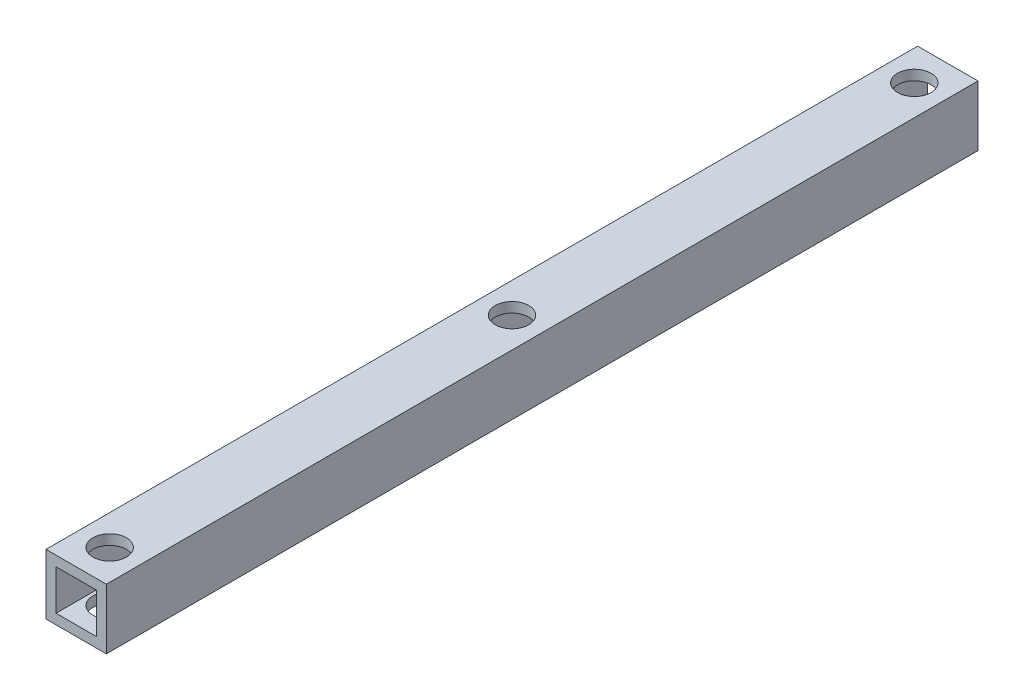
ISO-10303-21;
HEADER;
FILE_DESCRIPTION(('STEP AP214'),'2;1');
FILE_NAME('part.step','',(''),(''),'','','');
FILE_SCHEMA(('AUTOMOTIVE_DESIGN { 1 0 10303 214 1 1 1 1 }'));
ENDSEC;
DATA;
#1=APPLICATION_CONTEXT('core data for automotive mechanical design processes');
#2=APPLICATION_PROTOCOL_DEFINITION('international standard','automotive_design',2000,#1);
#3=PRODUCT_CONTEXT('',#1,'mechanical');
#4=PRODUCT('Part','Part','',(#3));
#5=PRODUCT_RELATED_PRODUCT_CATEGORY('part','',(#4));
#6=PRODUCT_DEFINITION_FORMATION('','',#4);
#7=PRODUCT_DEFINITION_CONTEXT('part definition',#1,'design');
#8=PRODUCT_DEFINITION('design','',#6,#7);
#9=PRODUCT_DEFINITION_SHAPE('','',#8);
#10=(LENGTH_UNIT() NAMED_UNIT(*) SI_UNIT(.MILLI.,.METRE.));
#11=(NAMED_UNIT(*) PLANE_ANGLE_UNIT() SI_UNIT($,.RADIAN.));
#12=(NAMED_UNIT(*) SI_UNIT($,.STERADIAN.) SOLID_ANGLE_UNIT());
#13=UNCERTAINTY_MEASURE_WITH_UNIT(LENGTH_MEASURE(1.E-05),#10,'distance_accuracy_value','');
#14=(GEOMETRIC_REPRESENTATION_CONTEXT(3) GLOBAL_UNCERTAINTY_ASSIGNED_CONTEXT((#13)) GLOBAL_UNIT_ASSIGNED_CONTEXT((#10,
#11,#12)) REPRESENTATION_CONTEXT('',''));
#15=CARTESIAN_POINT('',(0.,0.,0.));
#16=DIRECTION('',(0.,0.,1.));
#17=DIRECTION('',(1.,0.,0.));
#18=AXIS2_PLACEMENT_3D('',#15,#16,#17);
#19=CARTESIAN_POINT('',(0.,0.,130.));
#20=DIRECTION('',(0.,0.,1.));
#21=DIRECTION('',(1.,0.,0.));
#22=AXIS2_PLACEMENT_3D('',#19,#20,#21);
#23=PLANE('',#22);
#24=DIRECTION('',(0.,1.,0.));
#25=VECTOR('',#24,1.);
#26=CARTESIAN_POINT('',(4.5,4.5,130.));
#27=LINE('',#26,#25);
#28=CARTESIAN_POINT('',(4.5,-4.5,130.));
#29=VERTEX_POINT('',#28);
#30=CARTESIAN_POINT('',(4.5,4.5,130.));
#31=VERTEX_POINT('',#30);
#32=EDGE_CURVE('E148',#29,#31,#27,.T.);
#33=ORIENTED_EDGE('',*,*,#32,.T.);
#34=DIRECTION('',(-1.,0.,0.));
#35=VECTOR('',#34,1.);
#36=CARTESIAN_POINT('',(-4.5,4.5,130.));
#37=LINE('',#36,#35);
#38=CARTESIAN_POINT('',(-4.5,4.5,130.));
#39=VERTEX_POINT('',#38);
#40=EDGE_CURVE('E151',#31,#39,#37,.T.);
#41=ORIENTED_EDGE('',*,*,#40,.T.);
#42=DIRECTION('',(0.,-1.,0.));
#43=VECTOR('',#42,1.);
#44=CARTESIAN_POINT('',(-4.5,4.5,130.));
#45=LINE('',#44,#43);
#46=CARTESIAN_POINT('',(-4.5,-4.5,130.));
#47=VERTEX_POINT('',#46);
#48=EDGE_CURVE('E154',#39,#47,#45,.T.);
#49=ORIENTED_EDGE('',*,*,#48,.T.);
#50=DIRECTION('',(1.,0.,0.));
#51=VECTOR('',#50,1.);
#52=CARTESIAN_POINT('',(-4.5,-4.5,130.));
#53=LINE('',#52,#51);
#54=EDGE_CURVE('E156',#47,#29,#53,.T.);
#55=ORIENTED_EDGE('',*,*,#54,.T.);
#56=EDGE_LOOP('',(#33,#41,#49,#55));
#57=FACE_BOUND('',#56,.T.);
#58=DIRECTION('',(-1.,0.,0.));
#59=VECTOR('',#58,1.);
#60=CARTESIAN_POINT('',(-3.,3.,130.));
#61=LINE('',#60,#59);
#62=CARTESIAN_POINT('',(3.,3.,130.));
#63=VERTEX_POINT('',#62);
#64=CARTESIAN_POINT('',(-3.,3.,130.));
#65=VERTEX_POINT('',#64);
#66=EDGE_CURVE('E118',#63,#65,#61,.T.);
#67=ORIENTED_EDGE('',*,*,#66,.F.);
#68=DIRECTION('',(0.,1.,0.));
#69=VECTOR('',#68,1.);
#70=CARTESIAN_POINT('',(3.,3.,130.));
#71=LINE('',#70,#69);
#72=CARTESIAN_POINT('',(3.,-3.,130.));
#73=VERTEX_POINT('',#72);
#74=EDGE_CURVE('E110',#73,#63,#71,.T.);
#75=ORIENTED_EDGE('',*,*,#74,.F.);
#76=DIRECTION('',(1.,0.,0.));
#77=VECTOR('',#76,1.);
#78=CARTESIAN_POINT('',(-3.,-3.,130.));
#79=LINE('',#78,#77);
#80=CARTESIAN_POINT('',(-3.,-3.,130.));
#81=VERTEX_POINT('',#80);
#82=EDGE_CURVE('E132',#81,#73,#79,.T.);
#83=ORIENTED_EDGE('',*,*,#82,.F.);
#84=DIRECTION('',(0.,-1.,0.));
#85=VECTOR('',#84,1.);
#86=CARTESIAN_POINT('',(-3.,3.,130.));
#87=LINE('',#86,#85);
#88=EDGE_CURVE('E130',#65,#81,#87,.T.);
#89=ORIENTED_EDGE('',*,*,#88,.F.);
#90=EDGE_LOOP('',(#67,#75,#83,#89));
#91=FACE_BOUND('',#90,.T.);
#92=ADVANCED_FACE('F43',(#57,#91),#23,.T.);
#93=CARTESIAN_POINT('',(0.,0.,0.));
#94=DIRECTION('',(0.,0.,1.));
#95=DIRECTION('',(1.,0.,0.));
#96=AXIS2_PLACEMENT_3D('',#93,#94,#95);
#97=PLANE('',#96);
#98=DIRECTION('',(0.,1.,0.));
#99=VECTOR('',#98,1.);
#100=CARTESIAN_POINT('',(4.5,4.5,0.));
#101=LINE('',#100,#99);
#102=CARTESIAN_POINT('',(4.5,-4.5,0.));
#103=VERTEX_POINT('',#102);
#104=CARTESIAN_POINT('',(4.5,4.5,0.));
#105=VERTEX_POINT('',#104);
#106=EDGE_CURVE('E126',#103,#105,#101,.T.);
#107=ORIENTED_EDGE('',*,*,#106,.F.);
#108=DIRECTION('',(1.,0.,0.));
#109=VECTOR('',#108,1.);
#110=CARTESIAN_POINT('',(-4.5,-4.5,0.));
#111=LINE('',#110,#109);
#112=CARTESIAN_POINT('',(-4.5,-4.5,0.));
#113=VERTEX_POINT('',#112);
#114=EDGE_CURVE('E152',#113,#103,#111,.T.);
#115=ORIENTED_EDGE('',*,*,#114,.F.);
#116=DIRECTION('',(0.,-1.,0.));
#117=VECTOR('',#116,1.);
#118=CARTESIAN_POINT('',(-4.5,4.5,0.));
#119=LINE('',#118,#117);
#120=CARTESIAN_POINT('',(-4.5,4.5,0.));
#121=VERTEX_POINT('',#120);
#122=EDGE_CURVE('E163',#121,#113,#119,.T.);
#123=ORIENTED_EDGE('',*,*,#122,.F.);
#124=DIRECTION('',(-1.,0.,0.));
#125=VECTOR('',#124,1.);
#126=CARTESIAN_POINT('',(-4.5,4.5,0.));
#127=LINE('',#126,#125);
#128=EDGE_CURVE('E161',#105,#121,#127,.T.);
#129=ORIENTED_EDGE('',*,*,#128,.F.);
#130=EDGE_LOOP('',(#107,#115,#123,#129));
#131=FACE_BOUND('',#130,.T.);
#132=DIRECTION('',(0.,1.,0.));
#133=VECTOR('',#132,1.);
#134=CARTESIAN_POINT('',(3.,3.,0.));
#135=LINE('',#134,#133);
#136=CARTESIAN_POINT('',(3.,-3.,0.));
#137=VERTEX_POINT('',#136);
#138=CARTESIAN_POINT('',(3.,3.,0.));
#139=VERTEX_POINT('',#138);
#140=EDGE_CURVE('E68',#137,#139,#135,.T.);
#141=ORIENTED_EDGE('',*,*,#140,.T.);
#142=DIRECTION('',(-1.,0.,0.));
#143=VECTOR('',#142,1.);
#144=CARTESIAN_POINT('',(-3.,3.,0.));
#145=LINE('',#144,#143);
#146=CARTESIAN_POINT('',(-3.,3.,0.));
#147=VERTEX_POINT('',#146);
#148=EDGE_CURVE('E125',#139,#147,#145,.T.);
#149=ORIENTED_EDGE('',*,*,#148,.T.);
#150=DIRECTION('',(0.,-1.,0.));
#151=VECTOR('',#150,1.);
#152=CARTESIAN_POINT('',(-3.,3.,0.));
#153=LINE('',#152,#151);
#154=CARTESIAN_POINT('',(-3.,-3.,0.));
#155=VERTEX_POINT('',#154);
#156=EDGE_CURVE('E140',#147,#155,#153,.T.);
#157=ORIENTED_EDGE('',*,*,#156,.T.);
#158=DIRECTION('',(1.,0.,0.));
#159=VECTOR('',#158,1.);
#160=CARTESIAN_POINT('',(-3.,-3.,0.));
#161=LINE('',#160,#159);
#162=EDGE_CURVE('E119',#155,#137,#161,.T.);
#163=ORIENTED_EDGE('',*,*,#162,.T.);
#164=EDGE_LOOP('',(#141,#149,#157,#163));
#165=FACE_BOUND('',#164,.T.);
#166=ADVANCED_FACE('F224',(#131,#165),#97,.F.);
#167=CARTESIAN_POINT('',(4.5,4.5,130.));
#168=DIRECTION('',(-1.,0.,0.));
#169=DIRECTION('',(0.,0.,1.));
#170=AXIS2_PLACEMENT_3D('',#167,#168,#169);
#171=PLANE('',#170);
#172=ORIENTED_EDGE('',*,*,#106,.T.);
#173=DIRECTION('',(0.,0.,-1.));
#174=VECTOR('',#173,1.);
#175=CARTESIAN_POINT('',(4.5,4.5,130.));
#176=LINE('',#175,#174);
#177=EDGE_CURVE('E12',#31,#105,#176,.T.);
#178=ORIENTED_EDGE('',*,*,#177,.F.);
#179=ORIENTED_EDGE('',*,*,#32,.F.);
#180=DIRECTION('',(0.,0.,-1.));
#181=VECTOR('',#180,1.);
#182=CARTESIAN_POINT('',(4.5,-4.5,130.));
#183=LINE('',#182,#181);
#184=EDGE_CURVE('E158',#29,#103,#183,.T.);
#185=ORIENTED_EDGE('',*,*,#184,.T.);
#186=EDGE_LOOP('',(#172,#178,#179,#185));
#187=FACE_BOUND('',#186,.T.);
#188=ADVANCED_FACE('F45',(#187),#171,.F.);
#189=CARTESIAN_POINT('',(-4.5,4.5,130.));
#190=DIRECTION('',(0.,-1.,0.));
#191=DIRECTION('',(0.,0.,-1.));
#192=AXIS2_PLACEMENT_3D('',#189,#190,#191);
#193=PLANE('',#192);
#194=CARTESIAN_POINT('',(0.,4.5,125.));
#195=DIRECTION('',(0.,1.,0.));
#196=DIRECTION('',(-1.,0.,0.));
#197=AXIS2_PLACEMENT_3D('',#194,#195,#196);
#198=CIRCLE('',#197,2.5);
#199=CARTESIAN_POINT('',(-2.5,4.5,125.));
#200=VERTEX_POINT('',#199);
#201=EDGE_CURVE('E176',#200,#200,#198,.T.);
#202=ORIENTED_EDGE('',*,*,#201,.F.);
#203=EDGE_LOOP('',(#202));
#204=FACE_BOUND('',#203,.T.);
#205=CARTESIAN_POINT('',(0.,4.5,65.));
#206=DIRECTION('',(0.,1.,0.));
#207=DIRECTION('',(-1.,0.,0.));
#208=AXIS2_PLACEMENT_3D('',#205,#206,#207);
#209=CIRCLE('',#208,2.5);
#210=CARTESIAN_POINT('',(-2.5,4.5,65.));
#211=VERTEX_POINT('',#210);
#212=EDGE_CURVE('E253',#211,#211,#209,.T.);
#213=ORIENTED_EDGE('',*,*,#212,.F.);
#214=EDGE_LOOP('',(#213));
#215=FACE_BOUND('',#214,.T.);
#216=CARTESIAN_POINT('',(0.,4.5,5.));
#217=DIRECTION('',(0.,1.,0.));
#218=DIRECTION('',(-1.,0.,0.));
#219=AXIS2_PLACEMENT_3D('',#216,#217,#218);
#220=CIRCLE('',#219,2.5);
#221=CARTESIAN_POINT('',(-2.5,4.5,5.));
#222=VERTEX_POINT('',#221);
#223=EDGE_CURVE('E257',#222,#222,#220,.T.);
#224=ORIENTED_EDGE('',*,*,#223,.F.);
#225=EDGE_LOOP('',(#224));
#226=FACE_BOUND('',#225,.T.);
#227=ORIENTED_EDGE('',*,*,#128,.T.);
#228=DIRECTION('',(0.,0.,-1.));
#229=VECTOR('',#228,1.);
#230=CARTESIAN_POINT('',(-4.5,4.5,130.));
#231=LINE('',#230,#229);
#232=EDGE_CURVE('E52',#39,#121,#231,.T.);
#233=ORIENTED_EDGE('',*,*,#232,.F.);
#234=ORIENTED_EDGE('',*,*,#40,.F.);
#235=ORIENTED_EDGE('',*,*,#177,.T.);
#236=EDGE_LOOP('',(#227,#233,#234,#235));
#237=FACE_BOUND('',#236,.T.);
#238=ADVANCED_FACE('F239',(#204,#215,#226,#237),#193,.F.);
#239=CARTESIAN_POINT('',(-4.5,4.5,130.));
#240=DIRECTION('',(1.,0.,0.));
#241=DIRECTION('',(0.,0.,-1.));
#242=AXIS2_PLACEMENT_3D('',#239,#240,#241);
#243=PLANE('',#242);
#244=ORIENTED_EDGE('',*,*,#122,.T.);
#245=DIRECTION('',(0.,0.,-1.));
#246=VECTOR('',#245,1.);
#247=CARTESIAN_POINT('',(-4.5,-4.5,130.));
#248=LINE('',#247,#246);
#249=EDGE_CURVE('E168',#47,#113,#248,.T.);
#250=ORIENTED_EDGE('',*,*,#249,.F.);
#251=ORIENTED_EDGE('',*,*,#48,.F.);
#252=ORIENTED_EDGE('',*,*,#232,.T.);
#253=EDGE_LOOP('',(#244,#250,#251,#252));
#254=FACE_BOUND('',#253,.T.);
#255=ADVANCED_FACE('F237',(#254),#243,.F.);
#256=CARTESIAN_POINT('',(-4.5,-4.5,130.));
#257=DIRECTION('',(0.,1.,0.));
#258=DIRECTION('',(0.,0.,1.));
#259=AXIS2_PLACEMENT_3D('',#256,#257,#258);
#260=PLANE('',#259);
#261=CARTESIAN_POINT('',(0.,-4.5,125.));
#262=DIRECTION('',(0.,1.,0.));
#263=DIRECTION('',(0.,0.,1.));
#264=AXIS2_PLACEMENT_3D('',#261,#262,#263);
#265=CIRCLE('',#264,2.5);
#266=CARTESIAN_POINT('',(0.,-4.5,127.5));
#267=VERTEX_POINT('',#266);
#268=EDGE_CURVE('E138',#267,#267,#265,.T.);
#269=ORIENTED_EDGE('',*,*,#268,.T.);
#270=EDGE_LOOP('',(#269));
#271=FACE_BOUND('',#270,.T.);
#272=CARTESIAN_POINT('',(0.,-4.5,65.));
#273=DIRECTION('',(0.,1.,0.));
#274=DIRECTION('',(0.,0.,1.));
#275=AXIS2_PLACEMENT_3D('',#272,#273,#274);
#276=CIRCLE('',#275,2.5);
#277=CARTESIAN_POINT('',(0.,-4.5,67.5));
#278=VERTEX_POINT('',#277);
#279=EDGE_CURVE('E184',#278,#278,#276,.T.);
#280=ORIENTED_EDGE('',*,*,#279,.T.);
#281=EDGE_LOOP('',(#280));
#282=FACE_BOUND('',#281,.T.);
#283=CARTESIAN_POINT('',(0.,-4.5,5.));
#284=DIRECTION('',(0.,1.,0.));
#285=DIRECTION('',(0.,0.,1.));
#286=AXIS2_PLACEMENT_3D('',#283,#284,#285);
#287=CIRCLE('',#286,2.5);
#288=CARTESIAN_POINT('',(0.,-4.5,7.5));
#289=VERTEX_POINT('',#288);
#290=EDGE_CURVE('E180',#289,#289,#287,.T.);
#291=ORIENTED_EDGE('',*,*,#290,.T.);
#292=EDGE_LOOP('',(#291));
#293=FACE_BOUND('',#292,.T.);
#294=ORIENTED_EDGE('',*,*,#114,.T.);
#295=ORIENTED_EDGE('',*,*,#184,.F.);
#296=ORIENTED_EDGE('',*,*,#54,.F.);
#297=ORIENTED_EDGE('',*,*,#249,.T.);
#298=EDGE_LOOP('',(#294,#295,#296,#297));
#299=FACE_BOUND('',#298,.T.);
#300=ADVANCED_FACE('F201',(#271,#282,#293,#299),#260,.F.);
#301=CARTESIAN_POINT('',(3.,3.,130.));
#302=DIRECTION('',(-1.,0.,0.));
#303=DIRECTION('',(0.,0.,1.));
#304=AXIS2_PLACEMENT_3D('',#301,#302,#303);
#305=PLANE('',#304);
#306=ORIENTED_EDGE('',*,*,#140,.F.);
#307=DIRECTION('',(0.,0.,-1.));
#308=VECTOR('',#307,1.);
#309=CARTESIAN_POINT('',(3.,-3.,130.));
#310=LINE('',#309,#308);
#311=EDGE_CURVE('E114',#73,#137,#310,.T.);
#312=ORIENTED_EDGE('',*,*,#311,.F.);
#313=ORIENTED_EDGE('',*,*,#74,.T.);
#314=DIRECTION('',(0.,0.,-1.));
#315=VECTOR('',#314,1.);
#316=CARTESIAN_POINT('',(3.,3.,130.));
#317=LINE('',#316,#315);
#318=EDGE_CURVE('E113',#63,#139,#317,.T.);
#319=ORIENTED_EDGE('',*,*,#318,.T.);
#320=EDGE_LOOP('',(#306,#312,#313,#319));
#321=FACE_BOUND('',#320,.T.);
#322=ADVANCED_FACE('F112',(#321),#305,.T.);
#323=CARTESIAN_POINT('',(-3.,3.,130.));
#324=DIRECTION('',(0.,-1.,0.));
#325=DIRECTION('',(0.,0.,-1.));
#326=AXIS2_PLACEMENT_3D('',#323,#324,#325);
#327=PLANE('',#326);
#328=CARTESIAN_POINT('',(0.,3.,125.));
#329=DIRECTION('',(0.,-1.,0.));
#330=DIRECTION('',(0.,0.,-1.));
#331=AXIS2_PLACEMENT_3D('',#328,#329,#330);
#332=CIRCLE('',#331,2.5);
#333=CARTESIAN_POINT('',(0.,3.,122.5));
#334=VERTEX_POINT('',#333);
#335=EDGE_CURVE('E196',#334,#334,#332,.T.);
#336=ORIENTED_EDGE('',*,*,#335,.F.);
#337=EDGE_LOOP('',(#336));
#338=FACE_BOUND('',#337,.T.);
#339=CARTESIAN_POINT('',(0.,3.,65.));
#340=DIRECTION('',(0.,-1.,0.));
#341=DIRECTION('',(0.,0.,-1.));
#342=AXIS2_PLACEMENT_3D('',#339,#340,#341);
#343=CIRCLE('',#342,2.5);
#344=CARTESIAN_POINT('',(0.,3.,62.5));
#345=VERTEX_POINT('',#344);
#346=EDGE_CURVE('E179',#345,#345,#343,.T.);
#347=ORIENTED_EDGE('',*,*,#346,.F.);
#348=EDGE_LOOP('',(#347));
#349=FACE_BOUND('',#348,.T.);
#350=CARTESIAN_POINT('',(0.,3.,5.));
#351=DIRECTION('',(0.,-1.,0.));
#352=DIRECTION('',(0.,0.,-1.));
#353=AXIS2_PLACEMENT_3D('',#350,#351,#352);
#354=CIRCLE('',#353,2.5);
#355=CARTESIAN_POINT('',(0.,3.,2.5));
#356=VERTEX_POINT('',#355);
#357=EDGE_CURVE('E175',#356,#356,#354,.T.);
#358=ORIENTED_EDGE('',*,*,#357,.F.);
#359=EDGE_LOOP('',(#358));
#360=FACE_BOUND('',#359,.T.);
#361=ORIENTED_EDGE('',*,*,#148,.F.);
#362=ORIENTED_EDGE('',*,*,#318,.F.);
#363=ORIENTED_EDGE('',*,*,#66,.T.);
#364=DIRECTION('',(0.,0.,-1.));
#365=VECTOR('',#364,1.);
#366=CARTESIAN_POINT('',(-3.,3.,130.));
#367=LINE('',#366,#365);
#368=EDGE_CURVE('E127',#65,#147,#367,.T.);
#369=ORIENTED_EDGE('',*,*,#368,.T.);
#370=EDGE_LOOP('',(#361,#362,#363,#369));
#371=FACE_BOUND('',#370,.T.);
#372=ADVANCED_FACE('F122',(#338,#349,#360,#371),#327,.T.);
#373=CARTESIAN_POINT('',(-3.,3.,130.));
#374=DIRECTION('',(1.,0.,0.));
#375=DIRECTION('',(0.,0.,-1.));
#376=AXIS2_PLACEMENT_3D('',#373,#374,#375);
#377=PLANE('',#376);
#378=ORIENTED_EDGE('',*,*,#156,.F.);
#379=ORIENTED_EDGE('',*,*,#368,.F.);
#380=ORIENTED_EDGE('',*,*,#88,.T.);
#381=DIRECTION('',(0.,0.,-1.));
#382=VECTOR('',#381,1.);
#383=CARTESIAN_POINT('',(-3.,-3.,130.));
#384=LINE('',#383,#382);
#385=EDGE_CURVE('E60',#81,#155,#384,.T.);
#386=ORIENTED_EDGE('',*,*,#385,.T.);
#387=EDGE_LOOP('',(#378,#379,#380,#386));
#388=FACE_BOUND('',#387,.T.);
#389=ADVANCED_FACE('F273',(#388),#377,.T.);
#390=CARTESIAN_POINT('',(-3.,-3.,130.));
#391=DIRECTION('',(0.,1.,0.));
#392=DIRECTION('',(0.,0.,1.));
#393=AXIS2_PLACEMENT_3D('',#390,#391,#392);
#394=PLANE('',#393);
#395=CARTESIAN_POINT('',(0.,-3.,125.));
#396=DIRECTION('',(0.,1.,0.));
#397=DIRECTION('',(0.,0.,1.));
#398=AXIS2_PLACEMENT_3D('',#395,#396,#397);
#399=CIRCLE('',#398,2.5);
#400=CARTESIAN_POINT('',(0.,-3.,127.5));
#401=VERTEX_POINT('',#400);
#402=EDGE_CURVE('E47',#401,#401,#399,.T.);
#403=ORIENTED_EDGE('',*,*,#402,.F.);
#404=EDGE_LOOP('',(#403));
#405=FACE_BOUND('',#404,.T.);
#406=CARTESIAN_POINT('',(0.,-3.,65.));
#407=DIRECTION('',(0.,1.,0.));
#408=DIRECTION('',(0.,0.,1.));
#409=AXIS2_PLACEMENT_3D('',#406,#407,#408);
#410=CIRCLE('',#409,2.5);
#411=CARTESIAN_POINT('',(0.,-3.,67.5));
#412=VERTEX_POINT('',#411);
#413=EDGE_CURVE('E177',#412,#412,#410,.T.);
#414=ORIENTED_EDGE('',*,*,#413,.F.);
#415=EDGE_LOOP('',(#414));
#416=FACE_BOUND('',#415,.T.);
#417=CARTESIAN_POINT('',(0.,-3.,5.));
#418=DIRECTION('',(0.,1.,0.));
#419=DIRECTION('',(0.,0.,1.));
#420=AXIS2_PLACEMENT_3D('',#417,#418,#419);
#421=CIRCLE('',#420,2.5);
#422=CARTESIAN_POINT('',(0.,-3.,7.5));
#423=VERTEX_POINT('',#422);
#424=EDGE_CURVE('E173',#423,#423,#421,.T.);
#425=ORIENTED_EDGE('',*,*,#424,.F.);
#426=EDGE_LOOP('',(#425));
#427=FACE_BOUND('',#426,.T.);
#428=ORIENTED_EDGE('',*,*,#162,.F.);
#429=ORIENTED_EDGE('',*,*,#385,.F.);
#430=ORIENTED_EDGE('',*,*,#82,.T.);
#431=ORIENTED_EDGE('',*,*,#311,.T.);
#432=EDGE_LOOP('',(#428,#429,#430,#431));
#433=FACE_BOUND('',#432,.T.);
#434=ADVANCED_FACE('F271',(#405,#416,#427,#433),#394,.T.);
#435=CARTESIAN_POINT('',(0.,-85.5,5.));
#436=DIRECTION('',(0.,1.,0.));
#437=DIRECTION('',(-1.,0.,0.));
#438=AXIS2_PLACEMENT_3D('',#435,#436,#437);
#439=CYLINDRICAL_SURFACE('',#438,2.5);
#440=ORIENTED_EDGE('',*,*,#424,.T.);
#441=EDGE_LOOP('',(#440));
#442=FACE_BOUND('',#441,.T.);
#443=ORIENTED_EDGE('',*,*,#290,.F.);
#444=EDGE_LOOP('',(#443));
#445=FACE_BOUND('',#444,.T.);
#446=ADVANCED_FACE('F218',(#442,#445),#439,.F.);
#447=CARTESIAN_POINT('',(0.,-85.5,65.));
#448=DIRECTION('',(0.,1.,0.));
#449=DIRECTION('',(-1.,0.,0.));
#450=AXIS2_PLACEMENT_3D('',#447,#448,#449);
#451=CYLINDRICAL_SURFACE('',#450,2.5);
#452=ORIENTED_EDGE('',*,*,#413,.T.);
#453=EDGE_LOOP('',(#452));
#454=FACE_BOUND('',#453,.T.);
#455=ORIENTED_EDGE('',*,*,#279,.F.);
#456=EDGE_LOOP('',(#455));
#457=FACE_BOUND('',#456,.T.);
#458=ADVANCED_FACE('F207',(#454,#457),#451,.F.);
#459=CARTESIAN_POINT('',(0.,-85.5,125.));
#460=DIRECTION('',(0.,1.,0.));
#461=DIRECTION('',(-1.,0.,0.));
#462=AXIS2_PLACEMENT_3D('',#459,#460,#461);
#463=CYLINDRICAL_SURFACE('',#462,2.5);
#464=ORIENTED_EDGE('',*,*,#402,.T.);
#465=EDGE_LOOP('',(#464));
#466=FACE_BOUND('',#465,.T.);
#467=ORIENTED_EDGE('',*,*,#268,.F.);
#468=EDGE_LOOP('',(#467));
#469=FACE_BOUND('',#468,.T.);
#470=ADVANCED_FACE('F204',(#466,#469),#463,.F.);
#471=ORIENTED_EDGE('',*,*,#357,.T.);
#472=EDGE_LOOP('',(#471));
#473=FACE_BOUND('',#472,.T.);
#474=ORIENTED_EDGE('',*,*,#223,.T.);
#475=EDGE_LOOP('',(#474));
#476=FACE_BOUND('',#475,.T.);
#477=ADVANCED_FACE('F206',(#473,#476),#439,.F.);
#478=ORIENTED_EDGE('',*,*,#346,.T.);
#479=EDGE_LOOP('',(#478));
#480=FACE_BOUND('',#479,.T.);
#481=ORIENTED_EDGE('',*,*,#212,.T.);
#482=EDGE_LOOP('',(#481));
#483=FACE_BOUND('',#482,.T.);
#484=ADVANCED_FACE('F215',(#480,#483),#451,.F.);
#485=ORIENTED_EDGE('',*,*,#335,.T.);
#486=EDGE_LOOP('',(#485));
#487=FACE_BOUND('',#486,.T.);
#488=ORIENTED_EDGE('',*,*,#201,.T.);
#489=EDGE_LOOP('',(#488));
#490=FACE_BOUND('',#489,.T.);
#491=ADVANCED_FACE('F210',(#487,#490),#463,.F.);
#492=CLOSED_SHELL('',(#92,#166,#188,#238,#255,#300,#322,#372,#389,#434,#446,#458,#470,#477,#484,#491));
#493=MANIFOLD_SOLID_BREP('B2',#492);
#494=ADVANCED_BREP_SHAPE_REPRESENTATION('',(#18,#493),#14);
#495=SHAPE_DEFINITION_REPRESENTATION(#9,#494);
ENDSEC;
END-ISO-10303-21;
